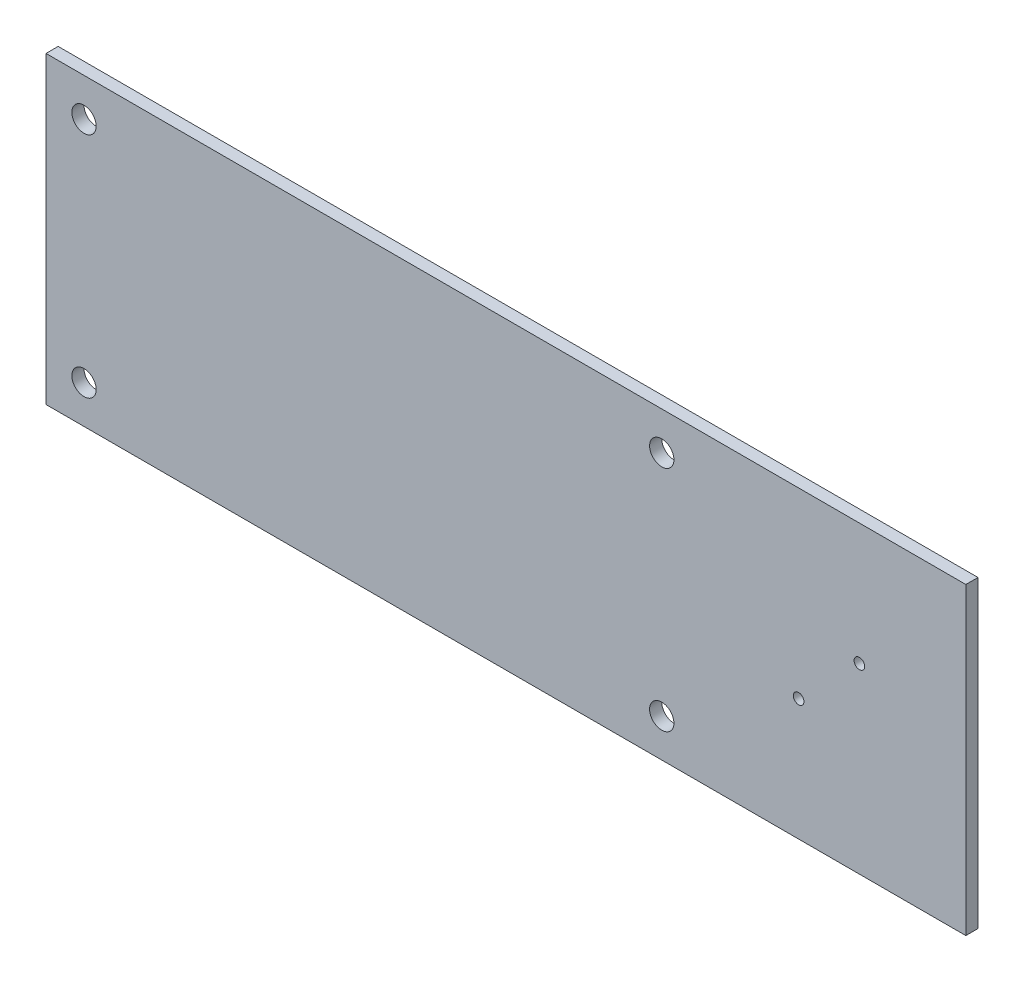
ISO-10303-21;
HEADER;
FILE_DESCRIPTION(('STEP AP214'),'2;1');
FILE_NAME('part.step','',(''),(''),'','','');
FILE_SCHEMA(('AUTOMOTIVE_DESIGN { 1 0 10303 214 1 1 1 1 }'));
ENDSEC;
DATA;
#1=APPLICATION_CONTEXT('core data for automotive mechanical design processes');
#2=APPLICATION_PROTOCOL_DEFINITION('international standard','automotive_design',2000,#1);
#3=PRODUCT_CONTEXT('',#1,'mechanical');
#4=PRODUCT('Part','Part','',(#3));
#5=PRODUCT_RELATED_PRODUCT_CATEGORY('part','',(#4));
#6=PRODUCT_DEFINITION_FORMATION('','',#4);
#7=PRODUCT_DEFINITION_CONTEXT('part definition',#1,'design');
#8=PRODUCT_DEFINITION('design','',#6,#7);
#9=PRODUCT_DEFINITION_SHAPE('','',#8);
#10=(LENGTH_UNIT() NAMED_UNIT(*) SI_UNIT(.MILLI.,.METRE.));
#11=(NAMED_UNIT(*) PLANE_ANGLE_UNIT() SI_UNIT($,.RADIAN.));
#12=(NAMED_UNIT(*) SI_UNIT($,.STERADIAN.) SOLID_ANGLE_UNIT());
#13=UNCERTAINTY_MEASURE_WITH_UNIT(LENGTH_MEASURE(1.E-05),#10,'distance_accuracy_value','');
#14=(GEOMETRIC_REPRESENTATION_CONTEXT(3) GLOBAL_UNCERTAINTY_ASSIGNED_CONTEXT((#13)) GLOBAL_UNIT_ASSIGNED_CONTEXT((#10,
#11,#12)) REPRESENTATION_CONTEXT('',''));
#15=CARTESIAN_POINT('',(0.,0.,0.));
#16=DIRECTION('',(0.,0.,1.));
#17=DIRECTION('',(1.,0.,0.));
#18=AXIS2_PLACEMENT_3D('',#15,#16,#17);
#19=CARTESIAN_POINT('',(0.,40.,1.6));
#20=DIRECTION('',(0.,0.,-1.));
#21=DIRECTION('',(-1.,0.,0.));
#22=AXIS2_PLACEMENT_3D('',#19,#20,#21);
#23=PLANE('',#22);
#24=CARTESIAN_POINT('',(107.,24.,1.6));
#25=DIRECTION('',(0.,0.,1.));
#26=DIRECTION('',(1.,0.,0.));
#27=AXIS2_PLACEMENT_3D('',#24,#25,#26);
#28=CIRCLE('',#27,0.700000000000001);
#29=CARTESIAN_POINT('',(107.7,24.,1.6));
#30=VERTEX_POINT('',#29);
#31=EDGE_CURVE('E131',#30,#30,#28,.T.);
#32=ORIENTED_EDGE('',*,*,#31,.F.);
#33=EDGE_LOOP('',(#32));
#34=FACE_BOUND('',#33,.T.);
#35=CARTESIAN_POINT('',(81.,5.,1.6));
#36=DIRECTION('',(0.,0.,1.));
#37=DIRECTION('',(1.,0.,0.));
#38=AXIS2_PLACEMENT_3D('',#35,#36,#37);
#39=CIRCLE('',#38,1.6);
#40=CARTESIAN_POINT('',(82.6,5.,1.6));
#41=VERTEX_POINT('',#40);
#42=EDGE_CURVE('E119',#41,#41,#39,.T.);
#43=ORIENTED_EDGE('',*,*,#42,.F.);
#44=EDGE_LOOP('',(#43));
#45=FACE_BOUND('',#44,.T.);
#46=CARTESIAN_POINT('',(5.,35.,1.6));
#47=DIRECTION('',(0.,0.,1.));
#48=DIRECTION('',(1.,0.,0.));
#49=AXIS2_PLACEMENT_3D('',#46,#47,#48);
#50=CIRCLE('',#49,1.6);
#51=CARTESIAN_POINT('',(6.6,35.,1.6));
#52=VERTEX_POINT('',#51);
#53=EDGE_CURVE('E98',#52,#52,#50,.T.);
#54=ORIENTED_EDGE('',*,*,#53,.F.);
#55=EDGE_LOOP('',(#54));
#56=FACE_BOUND('',#55,.T.);
#57=DIRECTION('',(0.,-1.,0.));
#58=VECTOR('',#57,1.);
#59=CARTESIAN_POINT('',(0.,0.,1.6));
#60=LINE('',#59,#58);
#61=CARTESIAN_POINT('',(0.,40.,1.6));
#62=VERTEX_POINT('',#61);
#63=CARTESIAN_POINT('',(0.,0.,1.6));
#64=VERTEX_POINT('',#63);
#65=EDGE_CURVE('E83',#62,#64,#60,.T.);
#66=ORIENTED_EDGE('',*,*,#65,.T.);
#67=DIRECTION('',(1.,0.,0.));
#68=VECTOR('',#67,1.);
#69=CARTESIAN_POINT('',(0.,0.,1.6));
#70=LINE('',#69,#68);
#71=CARTESIAN_POINT('',(121.,0.,1.6));
#72=VERTEX_POINT('',#71);
#73=EDGE_CURVE('E78',#64,#72,#70,.T.);
#74=ORIENTED_EDGE('',*,*,#73,.T.);
#75=DIRECTION('',(0.,1.,0.));
#76=VECTOR('',#75,1.);
#77=CARTESIAN_POINT('',(121.,0.,1.6));
#78=LINE('',#77,#76);
#79=CARTESIAN_POINT('',(121.,40.,1.6));
#80=VERTEX_POINT('',#79);
#81=EDGE_CURVE('E81',#72,#80,#78,.T.);
#82=ORIENTED_EDGE('',*,*,#81,.T.);
#83=DIRECTION('',(-1.,0.,0.));
#84=VECTOR('',#83,1.);
#85=CARTESIAN_POINT('',(0.,40.,1.6));
#86=LINE('',#85,#84);
#87=EDGE_CURVE('E48',#80,#62,#86,.T.);
#88=ORIENTED_EDGE('',*,*,#87,.T.);
#89=EDGE_LOOP('',(#66,#74,#82,#88));
#90=FACE_BOUND('',#89,.T.);
#91=CARTESIAN_POINT('',(5.,5.,1.6));
#92=DIRECTION('',(0.,0.,1.));
#93=DIRECTION('',(1.,0.,0.));
#94=AXIS2_PLACEMENT_3D('',#91,#92,#93);
#95=CIRCLE('',#94,1.6);
#96=CARTESIAN_POINT('',(6.6,5.,1.6));
#97=VERTEX_POINT('',#96);
#98=EDGE_CURVE('E113',#97,#97,#95,.T.);
#99=ORIENTED_EDGE('',*,*,#98,.F.);
#100=EDGE_LOOP('',(#99));
#101=FACE_BOUND('',#100,.T.);
#102=CARTESIAN_POINT('',(81.,35.,1.6));
#103=DIRECTION('',(0.,0.,1.));
#104=DIRECTION('',(1.,0.,0.));
#105=AXIS2_PLACEMENT_3D('',#102,#103,#104);
#106=CIRCLE('',#105,1.6);
#107=CARTESIAN_POINT('',(82.6,35.,1.6));
#108=VERTEX_POINT('',#107);
#109=EDGE_CURVE('E125',#108,#108,#106,.T.);
#110=ORIENTED_EDGE('',*,*,#109,.F.);
#111=EDGE_LOOP('',(#110));
#112=FACE_BOUND('',#111,.T.);
#113=CARTESIAN_POINT('',(99.,16.,1.6));
#114=DIRECTION('',(0.,0.,1.));
#115=DIRECTION('',(1.,0.,0.));
#116=AXIS2_PLACEMENT_3D('',#113,#114,#115);
#117=CIRCLE('',#116,0.700000000000002);
#118=CARTESIAN_POINT('',(99.7,16.,1.6));
#119=VERTEX_POINT('',#118);
#120=EDGE_CURVE('E137',#119,#119,#117,.T.);
#121=ORIENTED_EDGE('',*,*,#120,.F.);
#122=EDGE_LOOP('',(#121));
#123=FACE_BOUND('',#122,.T.);
#124=ADVANCED_FACE('F31',(#34,#45,#56,#90,#101,#112,#123),#23,.F.);
#125=CARTESIAN_POINT('',(0.,40.,0.));
#126=DIRECTION('',(0.,0.,-1.));
#127=DIRECTION('',(-1.,0.,0.));
#128=AXIS2_PLACEMENT_3D('',#125,#126,#127);
#129=PLANE('',#128);
#130=CARTESIAN_POINT('',(107.,24.,0.));
#131=DIRECTION('',(0.,0.,1.));
#132=DIRECTION('',(1.,0.,0.));
#133=AXIS2_PLACEMENT_3D('',#130,#131,#132);
#134=CIRCLE('',#133,0.700000000000001);
#135=CARTESIAN_POINT('',(107.7,24.,0.));
#136=VERTEX_POINT('',#135);
#137=EDGE_CURVE('E134',#136,#136,#134,.T.);
#138=ORIENTED_EDGE('',*,*,#137,.T.);
#139=EDGE_LOOP('',(#138));
#140=FACE_BOUND('',#139,.T.);
#141=CARTESIAN_POINT('',(81.,5.,0.));
#142=DIRECTION('',(0.,0.,1.));
#143=DIRECTION('',(1.,0.,0.));
#144=AXIS2_PLACEMENT_3D('',#141,#142,#143);
#145=CIRCLE('',#144,1.6);
#146=CARTESIAN_POINT('',(82.6,5.,0.));
#147=VERTEX_POINT('',#146);
#148=EDGE_CURVE('E122',#147,#147,#145,.T.);
#149=ORIENTED_EDGE('',*,*,#148,.T.);
#150=EDGE_LOOP('',(#149));
#151=FACE_BOUND('',#150,.T.);
#152=CARTESIAN_POINT('',(5.,35.,0.));
#153=DIRECTION('',(0.,0.,1.));
#154=DIRECTION('',(1.,0.,0.));
#155=AXIS2_PLACEMENT_3D('',#152,#153,#154);
#156=CIRCLE('',#155,1.6);
#157=CARTESIAN_POINT('',(6.6,35.,0.));
#158=VERTEX_POINT('',#157);
#159=EDGE_CURVE('E110',#158,#158,#156,.T.);
#160=ORIENTED_EDGE('',*,*,#159,.T.);
#161=EDGE_LOOP('',(#160));
#162=FACE_BOUND('',#161,.T.);
#163=DIRECTION('',(0.,-1.,0.));
#164=VECTOR('',#163,1.);
#165=CARTESIAN_POINT('',(0.,0.,0.));
#166=LINE('',#165,#164);
#167=CARTESIAN_POINT('',(0.,40.,0.));
#168=VERTEX_POINT('',#167);
#169=CARTESIAN_POINT('',(0.,0.,0.));
#170=VERTEX_POINT('',#169);
#171=EDGE_CURVE('E95',#168,#170,#166,.T.);
#172=ORIENTED_EDGE('',*,*,#171,.F.);
#173=DIRECTION('',(-1.,0.,0.));
#174=VECTOR('',#173,1.);
#175=CARTESIAN_POINT('',(0.,40.,0.));
#176=LINE('',#175,#174);
#177=CARTESIAN_POINT('',(121.,40.,0.));
#178=VERTEX_POINT('',#177);
#179=EDGE_CURVE('E71',#178,#168,#176,.T.);
#180=ORIENTED_EDGE('',*,*,#179,.F.);
#181=DIRECTION('',(0.,1.,0.));
#182=VECTOR('',#181,1.);
#183=CARTESIAN_POINT('',(121.,0.,0.));
#184=LINE('',#183,#182);
#185=CARTESIAN_POINT('',(121.,0.,0.));
#186=VERTEX_POINT('',#185);
#187=EDGE_CURVE('E65',#186,#178,#184,.T.);
#188=ORIENTED_EDGE('',*,*,#187,.F.);
#189=DIRECTION('',(1.,0.,0.));
#190=VECTOR('',#189,1.);
#191=CARTESIAN_POINT('',(0.,0.,0.));
#192=LINE('',#191,#190);
#193=EDGE_CURVE('E87',#170,#186,#192,.T.);
#194=ORIENTED_EDGE('',*,*,#193,.F.);
#195=EDGE_LOOP('',(#172,#180,#188,#194));
#196=FACE_BOUND('',#195,.T.);
#197=CARTESIAN_POINT('',(5.,5.,0.));
#198=DIRECTION('',(0.,0.,1.));
#199=DIRECTION('',(1.,0.,0.));
#200=AXIS2_PLACEMENT_3D('',#197,#198,#199);
#201=CIRCLE('',#200,1.6);
#202=CARTESIAN_POINT('',(6.6,5.,0.));
#203=VERTEX_POINT('',#202);
#204=EDGE_CURVE('E116',#203,#203,#201,.T.);
#205=ORIENTED_EDGE('',*,*,#204,.T.);
#206=EDGE_LOOP('',(#205));
#207=FACE_BOUND('',#206,.T.);
#208=CARTESIAN_POINT('',(81.,35.,0.));
#209=DIRECTION('',(0.,0.,1.));
#210=DIRECTION('',(1.,0.,0.));
#211=AXIS2_PLACEMENT_3D('',#208,#209,#210);
#212=CIRCLE('',#211,1.6);
#213=CARTESIAN_POINT('',(82.6,35.,0.));
#214=VERTEX_POINT('',#213);
#215=EDGE_CURVE('E128',#214,#214,#212,.T.);
#216=ORIENTED_EDGE('',*,*,#215,.T.);
#217=EDGE_LOOP('',(#216));
#218=FACE_BOUND('',#217,.T.);
#219=CARTESIAN_POINT('',(99.,16.,0.));
#220=DIRECTION('',(0.,0.,1.));
#221=DIRECTION('',(1.,0.,0.));
#222=AXIS2_PLACEMENT_3D('',#219,#220,#221);
#223=CIRCLE('',#222,0.700000000000002);
#224=CARTESIAN_POINT('',(99.7,16.,0.));
#225=VERTEX_POINT('',#224);
#226=EDGE_CURVE('E140',#225,#225,#223,.T.);
#227=ORIENTED_EDGE('',*,*,#226,.T.);
#228=EDGE_LOOP('',(#227));
#229=FACE_BOUND('',#228,.T.);
#230=ADVANCED_FACE('F106',(#140,#151,#162,#196,#207,#218,#229),#129,.T.);
#231=CARTESIAN_POINT('',(0.,0.,1.6));
#232=DIRECTION('',(1.,0.,0.));
#233=DIRECTION('',(0.,0.,-1.));
#234=AXIS2_PLACEMENT_3D('',#231,#232,#233);
#235=PLANE('',#234);
#236=ORIENTED_EDGE('',*,*,#171,.T.);
#237=DIRECTION('',(0.,0.,-1.));
#238=VECTOR('',#237,1.);
#239=CARTESIAN_POINT('',(0.,0.,1.6));
#240=LINE('',#239,#238);
#241=EDGE_CURVE('E11',#64,#170,#240,.T.);
#242=ORIENTED_EDGE('',*,*,#241,.F.);
#243=ORIENTED_EDGE('',*,*,#65,.F.);
#244=DIRECTION('',(0.,0.,-1.));
#245=VECTOR('',#244,1.);
#246=CARTESIAN_POINT('',(0.,40.,1.6));
#247=LINE('',#246,#245);
#248=EDGE_CURVE('E91',#62,#168,#247,.T.);
#249=ORIENTED_EDGE('',*,*,#248,.T.);
#250=EDGE_LOOP('',(#236,#242,#243,#249));
#251=FACE_BOUND('',#250,.T.);
#252=ADVANCED_FACE('F33',(#251),#235,.F.);
#253=CARTESIAN_POINT('',(0.,0.,1.6));
#254=DIRECTION('',(0.,1.,0.));
#255=DIRECTION('',(0.,0.,1.));
#256=AXIS2_PLACEMENT_3D('',#253,#254,#255);
#257=PLANE('',#256);
#258=ORIENTED_EDGE('',*,*,#193,.T.);
#259=DIRECTION('',(0.,0.,-1.));
#260=VECTOR('',#259,1.);
#261=CARTESIAN_POINT('',(121.,0.,1.6));
#262=LINE('',#261,#260);
#263=EDGE_CURVE('E40',#72,#186,#262,.T.);
#264=ORIENTED_EDGE('',*,*,#263,.F.);
#265=ORIENTED_EDGE('',*,*,#73,.F.);
#266=ORIENTED_EDGE('',*,*,#241,.T.);
#267=EDGE_LOOP('',(#258,#264,#265,#266));
#268=FACE_BOUND('',#267,.T.);
#269=ADVANCED_FACE('F86',(#268),#257,.F.);
#270=CARTESIAN_POINT('',(121.,0.,1.6));
#271=DIRECTION('',(-1.,0.,0.));
#272=DIRECTION('',(0.,0.,1.));
#273=AXIS2_PLACEMENT_3D('',#270,#271,#272);
#274=PLANE('',#273);
#275=ORIENTED_EDGE('',*,*,#187,.T.);
#276=DIRECTION('',(0.,0.,-1.));
#277=VECTOR('',#276,1.);
#278=CARTESIAN_POINT('',(121.,40.,1.6));
#279=LINE('',#278,#277);
#280=EDGE_CURVE('E88',#80,#178,#279,.T.);
#281=ORIENTED_EDGE('',*,*,#280,.F.);
#282=ORIENTED_EDGE('',*,*,#81,.F.);
#283=ORIENTED_EDGE('',*,*,#263,.T.);
#284=EDGE_LOOP('',(#275,#281,#282,#283));
#285=FACE_BOUND('',#284,.T.);
#286=ADVANCED_FACE('F89',(#285),#274,.F.);
#287=CARTESIAN_POINT('',(0.,40.,1.6));
#288=DIRECTION('',(0.,-1.,0.));
#289=DIRECTION('',(0.,0.,-1.));
#290=AXIS2_PLACEMENT_3D('',#287,#288,#289);
#291=PLANE('',#290);
#292=ORIENTED_EDGE('',*,*,#179,.T.);
#293=ORIENTED_EDGE('',*,*,#248,.F.);
#294=ORIENTED_EDGE('',*,*,#87,.F.);
#295=ORIENTED_EDGE('',*,*,#280,.T.);
#296=EDGE_LOOP('',(#292,#293,#294,#295));
#297=FACE_BOUND('',#296,.T.);
#298=ADVANCED_FACE('F103',(#297),#291,.F.);
#299=CARTESIAN_POINT('',(5.,35.,1.6));
#300=DIRECTION('',(0.,0.,-1.));
#301=DIRECTION('',(-1.,0.,0.));
#302=AXIS2_PLACEMENT_3D('',#299,#300,#301);
#303=CYLINDRICAL_SURFACE('',#302,1.6);
#304=ORIENTED_EDGE('',*,*,#53,.T.);
#305=EDGE_LOOP('',(#304));
#306=FACE_BOUND('',#305,.T.);
#307=ORIENTED_EDGE('',*,*,#159,.F.);
#308=EDGE_LOOP('',(#307));
#309=FACE_BOUND('',#308,.T.);
#310=ADVANCED_FACE('F160',(#306,#309),#303,.F.);
#311=CARTESIAN_POINT('',(5.,5.,1.6));
#312=DIRECTION('',(0.,0.,-1.));
#313=DIRECTION('',(-1.,0.,0.));
#314=AXIS2_PLACEMENT_3D('',#311,#312,#313);
#315=CYLINDRICAL_SURFACE('',#314,1.6);
#316=ORIENTED_EDGE('',*,*,#98,.T.);
#317=EDGE_LOOP('',(#316));
#318=FACE_BOUND('',#317,.T.);
#319=ORIENTED_EDGE('',*,*,#204,.F.);
#320=EDGE_LOOP('',(#319));
#321=FACE_BOUND('',#320,.T.);
#322=ADVANCED_FACE('F206',(#318,#321),#315,.F.);
#323=CARTESIAN_POINT('',(81.,5.,1.6));
#324=DIRECTION('',(0.,0.,-1.));
#325=DIRECTION('',(-1.,0.,0.));
#326=AXIS2_PLACEMENT_3D('',#323,#324,#325);
#327=CYLINDRICAL_SURFACE('',#326,1.6);
#328=ORIENTED_EDGE('',*,*,#42,.T.);
#329=EDGE_LOOP('',(#328));
#330=FACE_BOUND('',#329,.T.);
#331=ORIENTED_EDGE('',*,*,#148,.F.);
#332=EDGE_LOOP('',(#331));
#333=FACE_BOUND('',#332,.T.);
#334=ADVANCED_FACE('F214',(#330,#333),#327,.F.);
#335=CARTESIAN_POINT('',(81.,35.,1.6));
#336=DIRECTION('',(0.,0.,-1.));
#337=DIRECTION('',(-1.,0.,0.));
#338=AXIS2_PLACEMENT_3D('',#335,#336,#337);
#339=CYLINDRICAL_SURFACE('',#338,1.6);
#340=ORIENTED_EDGE('',*,*,#109,.T.);
#341=EDGE_LOOP('',(#340));
#342=FACE_BOUND('',#341,.T.);
#343=ORIENTED_EDGE('',*,*,#215,.F.);
#344=EDGE_LOOP('',(#343));
#345=FACE_BOUND('',#344,.T.);
#346=ADVANCED_FACE('F222',(#342,#345),#339,.F.);
#347=CARTESIAN_POINT('',(107.,24.,1.6));
#348=DIRECTION('',(0.,0.,-1.));
#349=DIRECTION('',(-1.,0.,0.));
#350=AXIS2_PLACEMENT_3D('',#347,#348,#349);
#351=CYLINDRICAL_SURFACE('',#350,0.700000000000001);
#352=ORIENTED_EDGE('',*,*,#31,.T.);
#353=EDGE_LOOP('',(#352));
#354=FACE_BOUND('',#353,.T.);
#355=ORIENTED_EDGE('',*,*,#137,.F.);
#356=EDGE_LOOP('',(#355));
#357=FACE_BOUND('',#356,.T.);
#358=ADVANCED_FACE('F231',(#354,#357),#351,.F.);
#359=CARTESIAN_POINT('',(99.,16.,1.6));
#360=DIRECTION('',(0.,0.,-1.));
#361=DIRECTION('',(-1.,0.,0.));
#362=AXIS2_PLACEMENT_3D('',#359,#360,#361);
#363=CYLINDRICAL_SURFACE('',#362,0.700000000000002);
#364=ORIENTED_EDGE('',*,*,#120,.T.);
#365=EDGE_LOOP('',(#364));
#366=FACE_BOUND('',#365,.T.);
#367=ORIENTED_EDGE('',*,*,#226,.F.);
#368=EDGE_LOOP('',(#367));
#369=FACE_BOUND('',#368,.T.);
#370=ADVANCED_FACE('F146',(#366,#369),#363,.F.);
#371=CLOSED_SHELL('',(#124,#230,#252,#269,#286,#298,#310,#322,#334,#346,#358,#370));
#372=MANIFOLD_SOLID_BREP('B2',#371);
#373=ADVANCED_BREP_SHAPE_REPRESENTATION('',(#18,#372),#14);
#374=SHAPE_DEFINITION_REPRESENTATION(#9,#373);
ENDSEC;
END-ISO-10303-21;
